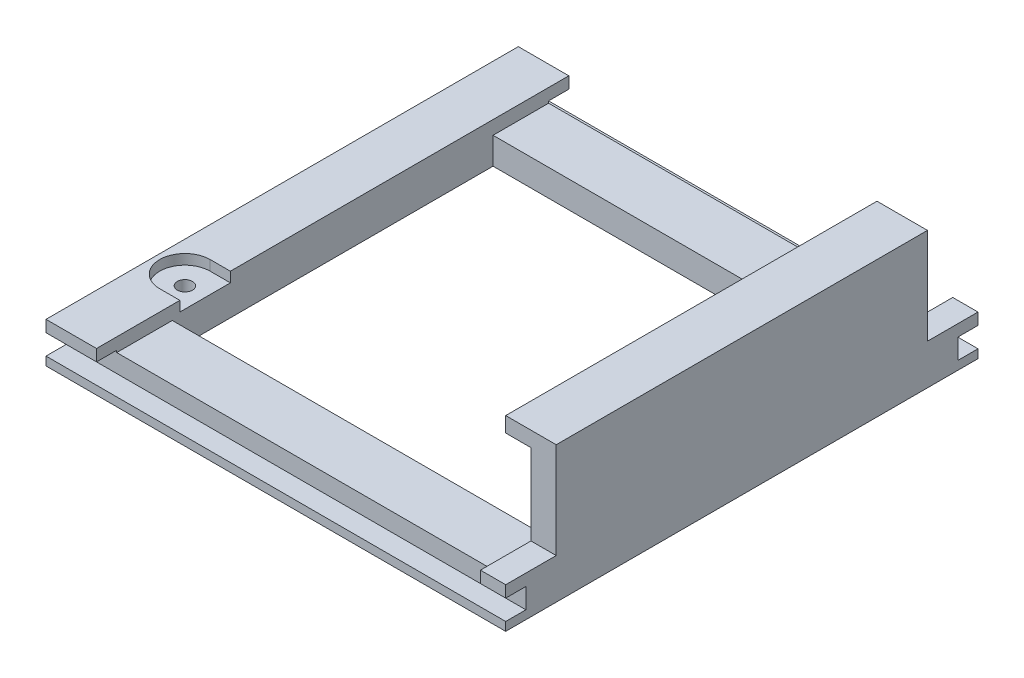
ISO-10303-21;
HEADER;
FILE_DESCRIPTION(('STEP AP214'),'2;1');
FILE_NAME('part.step','',(''),(''),'','','');
FILE_SCHEMA(('AUTOMOTIVE_DESIGN { 1 0 10303 214 1 1 1 1 }'));
ENDSEC;
DATA;
#1=APPLICATION_CONTEXT('core data for automotive mechanical design processes');
#2=APPLICATION_PROTOCOL_DEFINITION('international standard','automotive_design',2000,#1);
#3=PRODUCT_CONTEXT('',#1,'mechanical');
#4=PRODUCT('Part','Part','',(#3));
#5=PRODUCT_RELATED_PRODUCT_CATEGORY('part','',(#4));
#6=PRODUCT_DEFINITION_FORMATION('','',#4);
#7=PRODUCT_DEFINITION_CONTEXT('part definition',#1,'design');
#8=PRODUCT_DEFINITION('design','',#6,#7);
#9=PRODUCT_DEFINITION_SHAPE('','',#8);
#10=(LENGTH_UNIT() NAMED_UNIT(*) SI_UNIT(.MILLI.,.METRE.));
#11=(NAMED_UNIT(*) PLANE_ANGLE_UNIT() SI_UNIT($,.RADIAN.));
#12=(NAMED_UNIT(*) SI_UNIT($,.STERADIAN.) SOLID_ANGLE_UNIT());
#13=UNCERTAINTY_MEASURE_WITH_UNIT(LENGTH_MEASURE(1.E-05),#10,'distance_accuracy_value','');
#14=(GEOMETRIC_REPRESENTATION_CONTEXT(3) GLOBAL_UNCERTAINTY_ASSIGNED_CONTEXT((#13)) GLOBAL_UNIT_ASSIGNED_CONTEXT((#10,
#11,#12)) REPRESENTATION_CONTEXT('',''));
#15=CARTESIAN_POINT('',(0.,0.,0.));
#16=DIRECTION('',(0.,0.,1.));
#17=DIRECTION('',(1.,0.,0.));
#18=AXIS2_PLACEMENT_3D('',#15,#16,#17);
#19=CARTESIAN_POINT('',(43.,96.8478017212866,-46.75));
#20=DIRECTION('',(0.,0.,-1.));
#21=DIRECTION('',(-1.,0.,0.));
#22=AXIS2_PLACEMENT_3D('',#19,#20,#21);
#23=PLANE('',#22);
#24=DIRECTION('',(1.,0.,0.));
#25=VECTOR('',#24,1.);
#26=CARTESIAN_POINT('',(43.,5.7,-46.75));
#27=LINE('',#26,#25);
#28=CARTESIAN_POINT('',(-48.,5.7,-46.75));
#29=VERTEX_POINT('',#28);
#30=CARTESIAN_POINT('',(-38.,5.7,-46.75));
#31=VERTEX_POINT('',#30);
#32=EDGE_CURVE('E518',#29,#31,#27,.T.);
#33=ORIENTED_EDGE('',*,*,#32,.F.);
#34=DIRECTION('',(0.,-1.,0.));
#35=VECTOR('',#34,1.);
#36=CARTESIAN_POINT('',(-48.,96.8478017212866,-46.75));
#37=LINE('',#36,#35);
#38=CARTESIAN_POINT('',(-48.,8.,-46.75));
#39=VERTEX_POINT('',#38);
#40=EDGE_CURVE('E398',#39,#29,#37,.T.);
#41=ORIENTED_EDGE('',*,*,#40,.F.);
#42=DIRECTION('',(-1.,0.,0.));
#43=VECTOR('',#42,1.);
#44=CARTESIAN_POINT('',(-38.,8.,-46.75));
#45=LINE('',#44,#43);
#46=CARTESIAN_POINT('',(-38.,8.,-46.75));
#47=VERTEX_POINT('',#46);
#48=EDGE_CURVE('E346',#47,#39,#45,.T.);
#49=ORIENTED_EDGE('',*,*,#48,.F.);
#50=DIRECTION('',(0.,-1.,0.));
#51=VECTOR('',#50,1.);
#52=CARTESIAN_POINT('',(-38.,22.142135623731,-46.75));
#53=LINE('',#52,#51);
#54=EDGE_CURVE('E343',#47,#31,#53,.T.);
#55=ORIENTED_EDGE('',*,*,#54,.T.);
#56=EDGE_LOOP('',(#33,#41,#49,#55));
#57=FACE_BOUND('',#56,.T.);
#58=ADVANCED_FACE('F38',(#57),#23,.T.);
#59=DIRECTION('',(-1.,0.,0.));
#60=VECTOR('',#59,1.);
#61=CARTESIAN_POINT('',(43.,5.7,-46.75));
#62=LINE('',#61,#60);
#63=CARTESIAN_POINT('',(43.,5.7,-46.75));
#64=VERTEX_POINT('',#63);
#65=CARTESIAN_POINT('',(38.,5.7,-46.75));
#66=VERTEX_POINT('',#65);
#67=EDGE_CURVE('E291',#64,#66,#62,.T.);
#68=ORIENTED_EDGE('',*,*,#67,.T.);
#69=DIRECTION('',(0.,-1.,0.));
#70=VECTOR('',#69,1.);
#71=CARTESIAN_POINT('',(38.,22.142135623731,-46.75));
#72=LINE('',#71,#70);
#73=CARTESIAN_POINT('',(38.,8.,-46.75));
#74=VERTEX_POINT('',#73);
#75=EDGE_CURVE('E355',#74,#66,#72,.T.);
#76=ORIENTED_EDGE('',*,*,#75,.F.);
#77=DIRECTION('',(-1.,0.,0.));
#78=VECTOR('',#77,1.);
#79=CARTESIAN_POINT('',(43.,8.,-46.75));
#80=LINE('',#79,#78);
#81=CARTESIAN_POINT('',(43.,8.,-46.75));
#82=VERTEX_POINT('',#81);
#83=EDGE_CURVE('E369',#82,#74,#80,.T.);
#84=ORIENTED_EDGE('',*,*,#83,.F.);
#85=DIRECTION('',(0.,-1.,0.));
#86=VECTOR('',#85,1.);
#87=CARTESIAN_POINT('',(43.,96.8478017212866,-46.75));
#88=LINE('',#87,#86);
#89=EDGE_CURVE('E394',#82,#64,#88,.T.);
#90=ORIENTED_EDGE('',*,*,#89,.T.);
#91=EDGE_LOOP('',(#68,#76,#84,#90));
#92=FACE_BOUND('',#91,.T.);
#93=ADVANCED_FACE('F604',(#92),#23,.T.);
#94=CARTESIAN_POINT('',(43.,96.8478017212866,46.75));
#95=DIRECTION('',(0.,0.,1.));
#96=DIRECTION('',(1.,0.,0.));
#97=AXIS2_PLACEMENT_3D('',#94,#95,#96);
#98=PLANE('',#97);
#99=DIRECTION('',(-1.,0.,0.));
#100=VECTOR('',#99,1.);
#101=CARTESIAN_POINT('',(43.,1.7,46.75));
#102=LINE('',#101,#100);
#103=CARTESIAN_POINT('',(43.,1.7,46.75));
#104=VERTEX_POINT('',#103);
#105=CARTESIAN_POINT('',(-48.,1.7,46.75));
#106=VERTEX_POINT('',#105);
#107=EDGE_CURVE('E289',#104,#106,#102,.T.);
#108=ORIENTED_EDGE('',*,*,#107,.T.);
#109=DIRECTION('',(0.,-1.,0.));
#110=VECTOR('',#109,1.);
#111=CARTESIAN_POINT('',(-48.,96.8478017212866,46.75));
#112=LINE('',#111,#110);
#113=CARTESIAN_POINT('',(-48.,0.,46.75));
#114=VERTEX_POINT('',#113);
#115=EDGE_CURVE('E382',#106,#114,#112,.T.);
#116=ORIENTED_EDGE('',*,*,#115,.T.);
#117=DIRECTION('',(-1.,0.,0.));
#118=VECTOR('',#117,1.);
#119=CARTESIAN_POINT('',(43.,0.,46.75));
#120=LINE('',#119,#118);
#121=CARTESIAN_POINT('',(43.,0.,46.75));
#122=VERTEX_POINT('',#121);
#123=EDGE_CURVE('E368',#122,#114,#120,.T.);
#124=ORIENTED_EDGE('',*,*,#123,.F.);
#125=DIRECTION('',(0.,-1.,0.));
#126=VECTOR('',#125,1.);
#127=CARTESIAN_POINT('',(43.,96.8478017212866,46.75));
#128=LINE('',#127,#126);
#129=EDGE_CURVE('E386',#104,#122,#128,.T.);
#130=ORIENTED_EDGE('',*,*,#129,.F.);
#131=EDGE_LOOP('',(#108,#116,#124,#130));
#132=FACE_BOUND('',#131,.T.);
#133=ADVANCED_FACE('F602',(#132),#98,.T.);
#134=DIRECTION('',(-1.,0.,0.));
#135=VECTOR('',#134,1.);
#136=CARTESIAN_POINT('',(43.,5.7,46.75));
#137=LINE('',#136,#135);
#138=CARTESIAN_POINT('',(43.,5.7,46.75));
#139=VERTEX_POINT('',#138);
#140=CARTESIAN_POINT('',(38.,5.7,46.75));
#141=VERTEX_POINT('',#140);
#142=EDGE_CURVE('E306',#139,#141,#137,.T.);
#143=ORIENTED_EDGE('',*,*,#142,.F.);
#144=CARTESIAN_POINT('',(43.,8.,46.75));
#145=VERTEX_POINT('',#144);
#146=EDGE_CURVE('E387',#145,#139,#128,.T.);
#147=ORIENTED_EDGE('',*,*,#146,.F.);
#148=DIRECTION('',(1.,0.,0.));
#149=VECTOR('',#148,1.);
#150=CARTESIAN_POINT('',(43.,8.,46.75));
#151=LINE('',#150,#149);
#152=CARTESIAN_POINT('',(38.,8.,46.75));
#153=VERTEX_POINT('',#152);
#154=EDGE_CURVE('E361',#153,#145,#151,.T.);
#155=ORIENTED_EDGE('',*,*,#154,.F.);
#156=DIRECTION('',(0.,-1.,0.));
#157=VECTOR('',#156,1.);
#158=CARTESIAN_POINT('',(38.,22.142135623731,46.75));
#159=LINE('',#158,#157);
#160=EDGE_CURVE('E349',#153,#141,#159,.T.);
#161=ORIENTED_EDGE('',*,*,#160,.T.);
#162=EDGE_LOOP('',(#143,#147,#155,#161));
#163=FACE_BOUND('',#162,.T.);
#164=ADVANCED_FACE('F554',(#163),#98,.T.);
#165=CARTESIAN_POINT('',(0.,5.3,0.));
#166=DIRECTION('',(0.,-1.,0.));
#167=DIRECTION('',(0.,0.,-1.));
#168=AXIS2_PLACEMENT_3D('',#165,#166,#167);
#169=PLANE('',#168);
#170=DIRECTION('',(0.,0.,1.));
#171=VECTOR('',#170,1.);
#172=CARTESIAN_POINT('',(-38.,5.3,31.75));
#173=LINE('',#172,#171);
#174=CARTESIAN_POINT('',(-38.,5.3,31.75));
#175=VERTEX_POINT('',#174);
#176=CARTESIAN_POINT('',(-38.,5.3,42.75));
#177=VERTEX_POINT('',#176);
#178=EDGE_CURVE('E433',#175,#177,#173,.T.);
#179=ORIENTED_EDGE('',*,*,#178,.T.);
#180=DIRECTION('',(1.,0.,0.));
#181=VECTOR('',#180,1.);
#182=CARTESIAN_POINT('',(0.,5.3,42.75));
#183=LINE('',#182,#181);
#184=CARTESIAN_POINT('',(38.,5.3,42.75));
#185=VERTEX_POINT('',#184);
#186=EDGE_CURVE('E330',#177,#185,#183,.T.);
#187=ORIENTED_EDGE('',*,*,#186,.T.);
#188=DIRECTION('',(0.,0.,-1.));
#189=VECTOR('',#188,1.);
#190=CARTESIAN_POINT('',(38.,5.3,31.75));
#191=LINE('',#190,#189);
#192=CARTESIAN_POINT('',(38.,5.3,31.75));
#193=VERTEX_POINT('',#192);
#194=EDGE_CURVE('E427',#185,#193,#191,.T.);
#195=ORIENTED_EDGE('',*,*,#194,.T.);
#196=DIRECTION('',(-1.,0.,0.));
#197=VECTOR('',#196,1.);
#198=CARTESIAN_POINT('',(38.,5.3,31.75));
#199=LINE('',#198,#197);
#200=EDGE_CURVE('E429',#193,#175,#199,.T.);
#201=ORIENTED_EDGE('',*,*,#200,.T.);
#202=EDGE_LOOP('',(#179,#187,#195,#201));
#203=FACE_BOUND('',#202,.T.);
#204=ADVANCED_FACE('F562',(#203),#169,.F.);
#205=CARTESIAN_POINT('',(0.,5.3,0.));
#206=DIRECTION('',(0.,1.,0.));
#207=DIRECTION('',(0.,0.,1.));
#208=AXIS2_PLACEMENT_3D('',#205,#206,#207);
#209=PLANE('',#208);
#210=DIRECTION('',(1.,0.,0.));
#211=VECTOR('',#210,1.);
#212=CARTESIAN_POINT('',(0.,5.3,-42.75));
#213=LINE('',#212,#211);
#214=CARTESIAN_POINT('',(-38.,5.3,-42.75));
#215=VERTEX_POINT('',#214);
#216=CARTESIAN_POINT('',(38.,5.3,-42.75));
#217=VERTEX_POINT('',#216);
#218=EDGE_CURVE('E335',#215,#217,#213,.T.);
#219=ORIENTED_EDGE('',*,*,#218,.F.);
#220=DIRECTION('',(0.,0.,1.));
#221=VECTOR('',#220,1.);
#222=CARTESIAN_POINT('',(-38.,5.3,-31.75));
#223=LINE('',#222,#221);
#224=CARTESIAN_POINT('',(-38.,5.3,-31.75));
#225=VERTEX_POINT('',#224);
#226=EDGE_CURVE('E441',#215,#225,#223,.T.);
#227=ORIENTED_EDGE('',*,*,#226,.T.);
#228=DIRECTION('',(1.,0.,0.));
#229=VECTOR('',#228,1.);
#230=CARTESIAN_POINT('',(38.,5.3,-31.75));
#231=LINE('',#230,#229);
#232=CARTESIAN_POINT('',(38.,5.3,-31.75));
#233=VERTEX_POINT('',#232);
#234=EDGE_CURVE('E443',#225,#233,#231,.T.);
#235=ORIENTED_EDGE('',*,*,#234,.T.);
#236=DIRECTION('',(0.,0.,-1.));
#237=VECTOR('',#236,1.);
#238=CARTESIAN_POINT('',(38.,5.3,-31.75));
#239=LINE('',#238,#237);
#240=EDGE_CURVE('E409',#233,#217,#239,.T.);
#241=ORIENTED_EDGE('',*,*,#240,.T.);
#242=EDGE_LOOP('',(#219,#227,#235,#241));
#243=FACE_BOUND('',#242,.T.);
#244=ADVANCED_FACE('F583',(#243),#209,.T.);
#245=CARTESIAN_POINT('',(43.,8.,-36.75));
#246=DIRECTION('',(0.,0.,1.));
#247=DIRECTION('',(1.,0.,0.));
#248=AXIS2_PLACEMENT_3D('',#245,#246,#247);
#249=PLANE('',#248);
#250=DIRECTION('',(0.,-1.,0.));
#251=VECTOR('',#250,1.);
#252=CARTESIAN_POINT('',(43.,8.,-36.75));
#253=LINE('',#252,#251);
#254=CARTESIAN_POINT('',(43.,27.,-36.75));
#255=VERTEX_POINT('',#254);
#256=CARTESIAN_POINT('',(43.,8.,-36.75));
#257=VERTEX_POINT('',#256);
#258=EDGE_CURVE('E504',#255,#257,#253,.T.);
#259=ORIENTED_EDGE('',*,*,#258,.T.);
#260=DIRECTION('',(1.,0.,0.));
#261=VECTOR('',#260,1.);
#262=CARTESIAN_POINT('',(43.,8.,-36.75));
#263=LINE('',#262,#261);
#264=CARTESIAN_POINT('',(38.,8.,-36.75));
#265=VERTEX_POINT('',#264);
#266=EDGE_CURVE('E375',#265,#257,#263,.T.);
#267=ORIENTED_EDGE('',*,*,#266,.F.);
#268=DIRECTION('',(0.,1.,0.));
#269=VECTOR('',#268,1.);
#270=CARTESIAN_POINT('',(38.,5.3,-36.75));
#271=LINE('',#270,#269);
#272=CARTESIAN_POINT('',(38.,24.,-36.75));
#273=VERTEX_POINT('',#272);
#274=EDGE_CURVE('E430',#265,#273,#271,.T.);
#275=ORIENTED_EDGE('',*,*,#274,.T.);
#276=DIRECTION('',(-1.,0.,0.));
#277=VECTOR('',#276,1.);
#278=CARTESIAN_POINT('',(38.,24.,-36.75));
#279=LINE('',#278,#277);
#280=CARTESIAN_POINT('',(33.,24.,-36.75));
#281=VERTEX_POINT('',#280);
#282=EDGE_CURVE('E397',#273,#281,#279,.T.);
#283=ORIENTED_EDGE('',*,*,#282,.T.);
#284=DIRECTION('',(0.,1.,0.));
#285=VECTOR('',#284,1.);
#286=CARTESIAN_POINT('',(33.,27.,-36.75));
#287=LINE('',#286,#285);
#288=CARTESIAN_POINT('',(33.,27.,-36.75));
#289=VERTEX_POINT('',#288);
#290=EDGE_CURVE('E412',#281,#289,#287,.T.);
#291=ORIENTED_EDGE('',*,*,#290,.T.);
#292=DIRECTION('',(1.,0.,0.));
#293=VECTOR('',#292,1.);
#294=CARTESIAN_POINT('',(43.,27.,-36.75));
#295=LINE('',#294,#293);
#296=EDGE_CURVE('E415',#289,#255,#295,.T.);
#297=ORIENTED_EDGE('',*,*,#296,.T.);
#298=EDGE_LOOP('',(#259,#267,#275,#283,#291,#297));
#299=FACE_BOUND('',#298,.T.);
#300=ADVANCED_FACE('F40',(#299),#249,.F.);
#301=CARTESIAN_POINT('',(-38.,8.,-31.75));
#302=DIRECTION('',(0.,0.,1.));
#303=DIRECTION('',(1.,0.,0.));
#304=AXIS2_PLACEMENT_3D('',#301,#302,#303);
#305=PLANE('',#304);
#306=DIRECTION('',(0.,-1.,0.));
#307=VECTOR('',#306,1.);
#308=CARTESIAN_POINT('',(38.,8.,-31.75));
#309=LINE('',#308,#307);
#310=CARTESIAN_POINT('',(38.,0.,-31.75));
#311=VERTEX_POINT('',#310);
#312=EDGE_CURVE('E499',#233,#311,#309,.T.);
#313=ORIENTED_EDGE('',*,*,#312,.F.);
#314=ORIENTED_EDGE('',*,*,#234,.F.);
#315=DIRECTION('',(0.,-1.,0.));
#316=VECTOR('',#315,1.);
#317=CARTESIAN_POINT('',(-38.,8.,-31.75));
#318=LINE('',#317,#316);
#319=CARTESIAN_POINT('',(-38.,0.,-31.75));
#320=VERTEX_POINT('',#319);
#321=EDGE_CURVE('E497',#225,#320,#318,.T.);
#322=ORIENTED_EDGE('',*,*,#321,.T.);
#323=DIRECTION('',(-1.,0.,0.));
#324=VECTOR('',#323,1.);
#325=CARTESIAN_POINT('',(-38.,0.,-31.75));
#326=LINE('',#325,#324);
#327=EDGE_CURVE('E485',#311,#320,#326,.T.);
#328=ORIENTED_EDGE('',*,*,#327,.F.);
#329=EDGE_LOOP('',(#313,#314,#322,#328));
#330=FACE_BOUND('',#329,.T.);
#331=ADVANCED_FACE('F579',(#330),#305,.T.);
#332=CARTESIAN_POINT('',(-42.,8.,25.25));
#333=DIRECTION('',(0.,-1.,0.));
#334=DIRECTION('',(0.,0.,-1.));
#335=AXIS2_PLACEMENT_3D('',#332,#333,#334);
#336=CYLINDRICAL_SURFACE('',#335,1.5);
#337=CARTESIAN_POINT('',(-42.,0.,25.25));
#338=DIRECTION('',(0.,1.,0.));
#339=DIRECTION('',(0.,0.,1.));
#340=AXIS2_PLACEMENT_3D('',#337,#338,#339);
#341=CIRCLE('',#340,1.5);
#342=CARTESIAN_POINT('',(-42.,0.,26.75));
#343=VERTEX_POINT('',#342);
#344=EDGE_CURVE('E474',#343,#343,#341,.T.);
#345=ORIENTED_EDGE('',*,*,#344,.F.);
#346=EDGE_LOOP('',(#345));
#347=FACE_BOUND('',#346,.T.);
#348=CARTESIAN_POINT('',(-42.,6.,25.25));
#349=DIRECTION('',(0.,1.,0.));
#350=DIRECTION('',(0.,0.,1.));
#351=AXIS2_PLACEMENT_3D('',#348,#349,#350);
#352=CIRCLE('',#351,1.5);
#353=CARTESIAN_POINT('',(-42.,6.,26.75));
#354=VERTEX_POINT('',#353);
#355=EDGE_CURVE('E467',#354,#354,#352,.T.);
#356=ORIENTED_EDGE('',*,*,#355,.T.);
#357=EDGE_LOOP('',(#356));
#358=FACE_BOUND('',#357,.T.);
#359=ADVANCED_FACE('F655',(#347,#358),#336,.F.);
#360=CARTESIAN_POINT('',(0.,8.,0.));
#361=DIRECTION('',(0.,1.,0.));
#362=DIRECTION('',(0.,0.,1.));
#363=AXIS2_PLACEMENT_3D('',#360,#361,#362);
#364=PLANE('',#363);
#365=DIRECTION('',(0.,0.,1.));
#366=VECTOR('',#365,1.);
#367=CARTESIAN_POINT('',(-48.,8.,-36.75));
#368=LINE('',#367,#366);
#369=CARTESIAN_POINT('',(-48.,8.,46.75));
#370=VERTEX_POINT('',#369);
#371=EDGE_CURVE('E502',#39,#370,#368,.T.);
#372=ORIENTED_EDGE('',*,*,#371,.T.);
#373=DIRECTION('',(1.,0.,0.));
#374=VECTOR('',#373,1.);
#375=CARTESIAN_POINT('',(-38.,8.,46.75));
#376=LINE('',#375,#374);
#377=CARTESIAN_POINT('',(-38.,8.,46.75));
#378=VERTEX_POINT('',#377);
#379=EDGE_CURVE('E340',#370,#378,#376,.T.);
#380=ORIENTED_EDGE('',*,*,#379,.T.);
#381=DIRECTION('',(0.,0.,1.));
#382=VECTOR('',#381,1.);
#383=CARTESIAN_POINT('',(-38.,8.,31.75));
#384=LINE('',#383,#382);
#385=CARTESIAN_POINT('',(-38.,8.,30.25));
#386=VERTEX_POINT('',#385);
#387=EDGE_CURVE('E482',#386,#378,#384,.T.);
#388=ORIENTED_EDGE('',*,*,#387,.F.);
#389=DIRECTION('',(1.,0.,0.));
#390=VECTOR('',#389,1.);
#391=CARTESIAN_POINT('',(-42.,8.,30.25));
#392=LINE('',#391,#390);
#393=CARTESIAN_POINT('',(-42.,8.,30.25));
#394=VERTEX_POINT('',#393);
#395=EDGE_CURVE('E461',#394,#386,#392,.T.);
#396=ORIENTED_EDGE('',*,*,#395,.F.);
#397=CARTESIAN_POINT('',(-42.,8.,25.25));
#398=DIRECTION('',(0.,1.,0.));
#399=DIRECTION('',(0.,0.,1.));
#400=AXIS2_PLACEMENT_3D('',#397,#398,#399);
#401=CIRCLE('',#400,5.);
#402=CARTESIAN_POINT('',(-42.,8.,20.25));
#403=VERTEX_POINT('',#402);
#404=EDGE_CURVE('E438',#403,#394,#401,.T.);
#405=ORIENTED_EDGE('',*,*,#404,.F.);
#406=DIRECTION('',(-1.,0.,0.));
#407=VECTOR('',#406,1.);
#408=CARTESIAN_POINT('',(-38.,8.,20.25));
#409=LINE('',#408,#407);
#410=CARTESIAN_POINT('',(-38.,8.,20.25));
#411=VERTEX_POINT('',#410);
#412=EDGE_CURVE('E451',#411,#403,#409,.T.);
#413=ORIENTED_EDGE('',*,*,#412,.F.);
#414=EDGE_CURVE('E478',#47,#411,#384,.T.);
#415=ORIENTED_EDGE('',*,*,#414,.F.);
#416=ORIENTED_EDGE('',*,*,#48,.T.);
#417=EDGE_LOOP('',(#372,#380,#388,#396,#405,#413,#415,#416));
#418=FACE_BOUND('',#417,.T.);
#419=ADVANCED_FACE('F534',(#418),#364,.T.);
#420=CARTESIAN_POINT('',(0.,0.,0.));
#421=DIRECTION('',(0.,1.,0.));
#422=DIRECTION('',(0.,0.,1.));
#423=AXIS2_PLACEMENT_3D('',#420,#421,#422);
#424=PLANE('',#423);
#425=DIRECTION('',(0.,0.,1.));
#426=VECTOR('',#425,1.);
#427=CARTESIAN_POINT('',(-48.,0.,-36.75));
#428=LINE('',#427,#426);
#429=CARTESIAN_POINT('',(-48.,0.,-46.75));
#430=VERTEX_POINT('',#429);
#431=EDGE_CURVE('E501',#430,#114,#428,.T.);
#432=ORIENTED_EDGE('',*,*,#431,.F.);
#433=DIRECTION('',(1.,0.,0.));
#434=VECTOR('',#433,1.);
#435=CARTESIAN_POINT('',(43.,0.,-46.75));
#436=LINE('',#435,#434);
#437=CARTESIAN_POINT('',(43.,0.,-46.75));
#438=VERTEX_POINT('',#437);
#439=EDGE_CURVE('E390',#430,#438,#436,.T.);
#440=ORIENTED_EDGE('',*,*,#439,.T.);
#441=DIRECTION('',(0.,0.,-1.));
#442=VECTOR('',#441,1.);
#443=CARTESIAN_POINT('',(43.,0.,36.75));
#444=LINE('',#443,#442);
#445=EDGE_CURVE('E505',#122,#438,#444,.T.);
#446=ORIENTED_EDGE('',*,*,#445,.F.);
#447=ORIENTED_EDGE('',*,*,#123,.T.);
#448=EDGE_LOOP('',(#432,#440,#446,#447));
#449=FACE_BOUND('',#448,.T.);
#450=DIRECTION('',(0.,0.,-1.));
#451=VECTOR('',#450,1.);
#452=CARTESIAN_POINT('',(38.,0.,31.75));
#453=LINE('',#452,#451);
#454=CARTESIAN_POINT('',(38.,0.,31.75));
#455=VERTEX_POINT('',#454);
#456=EDGE_CURVE('E477',#455,#311,#453,.T.);
#457=ORIENTED_EDGE('',*,*,#456,.T.);
#458=ORIENTED_EDGE('',*,*,#327,.T.);
#459=DIRECTION('',(0.,0.,1.));
#460=VECTOR('',#459,1.);
#461=CARTESIAN_POINT('',(-38.,0.,31.75));
#462=LINE('',#461,#460);
#463=CARTESIAN_POINT('',(-38.,0.,31.75));
#464=VERTEX_POINT('',#463);
#465=EDGE_CURVE('E488',#320,#464,#462,.T.);
#466=ORIENTED_EDGE('',*,*,#465,.T.);
#467=DIRECTION('',(1.,0.,0.));
#468=VECTOR('',#467,1.);
#469=CARTESIAN_POINT('',(-38.,0.,31.75));
#470=LINE('',#469,#468);
#471=EDGE_CURVE('E491',#464,#455,#470,.T.);
#472=ORIENTED_EDGE('',*,*,#471,.T.);
#473=EDGE_LOOP('',(#457,#458,#466,#472));
#474=FACE_BOUND('',#473,.T.);
#475=ORIENTED_EDGE('',*,*,#344,.T.);
#476=EDGE_LOOP('',(#475));
#477=FACE_BOUND('',#476,.T.);
#478=ADVANCED_FACE('F575',(#449,#474,#477),#424,.F.);
#479=CARTESIAN_POINT('',(-48.,8.,-36.75));
#480=DIRECTION('',(1.,0.,0.));
#481=DIRECTION('',(0.,0.,-1.));
#482=AXIS2_PLACEMENT_3D('',#479,#480,#481);
#483=PLANE('',#482);
#484=ORIENTED_EDGE('',*,*,#40,.T.);
#485=DIRECTION('',(0.,0.,-1.));
#486=VECTOR('',#485,1.);
#487=CARTESIAN_POINT('',(-48.,5.7,-46.75));
#488=LINE('',#487,#486);
#489=CARTESIAN_POINT('',(-48.,5.7,-42.75));
#490=VERTEX_POINT('',#489);
#491=EDGE_CURVE('E282',#490,#29,#488,.T.);
#492=ORIENTED_EDGE('',*,*,#491,.F.);
#493=DIRECTION('',(0.,1.,0.));
#494=VECTOR('',#493,1.);
#495=CARTESIAN_POINT('',(-48.,1.7,-42.75));
#496=LINE('',#495,#494);
#497=CARTESIAN_POINT('',(-48.,1.7,-42.75));
#498=VERTEX_POINT('',#497);
#499=EDGE_CURVE('E284',#498,#490,#496,.T.);
#500=ORIENTED_EDGE('',*,*,#499,.F.);
#501=DIRECTION('',(0.,0.,1.));
#502=VECTOR('',#501,1.);
#503=CARTESIAN_POINT('',(-48.,1.7,-46.75));
#504=LINE('',#503,#502);
#505=CARTESIAN_POINT('',(-48.,1.7,-46.75));
#506=VERTEX_POINT('',#505);
#507=EDGE_CURVE('E261',#506,#498,#504,.T.);
#508=ORIENTED_EDGE('',*,*,#507,.F.);
#509=EDGE_CURVE('E393',#506,#430,#37,.T.);
#510=ORIENTED_EDGE('',*,*,#509,.T.);
#511=ORIENTED_EDGE('',*,*,#431,.T.);
#512=ORIENTED_EDGE('',*,*,#115,.F.);
#513=DIRECTION('',(0.,0.,1.));
#514=VECTOR('',#513,1.);
#515=CARTESIAN_POINT('',(-48.,1.7,46.75));
#516=LINE('',#515,#514);
#517=CARTESIAN_POINT('',(-48.,1.7,42.75));
#518=VERTEX_POINT('',#517);
#519=EDGE_CURVE('E300',#518,#106,#516,.T.);
#520=ORIENTED_EDGE('',*,*,#519,.F.);
#521=DIRECTION('',(0.,-1.,0.));
#522=VECTOR('',#521,1.);
#523=CARTESIAN_POINT('',(-48.,1.7,42.75));
#524=LINE('',#523,#522);
#525=CARTESIAN_POINT('',(-48.,5.7,42.75));
#526=VERTEX_POINT('',#525);
#527=EDGE_CURVE('E310',#526,#518,#524,.T.);
#528=ORIENTED_EDGE('',*,*,#527,.F.);
#529=DIRECTION('',(0.,0.,-1.));
#530=VECTOR('',#529,1.);
#531=CARTESIAN_POINT('',(-48.,5.7,46.75));
#532=LINE('',#531,#530);
#533=CARTESIAN_POINT('',(-48.,5.7,46.75));
#534=VERTEX_POINT('',#533);
#535=EDGE_CURVE('E307',#534,#526,#532,.T.);
#536=ORIENTED_EDGE('',*,*,#535,.F.);
#537=EDGE_CURVE('E383',#370,#534,#112,.T.);
#538=ORIENTED_EDGE('',*,*,#537,.F.);
#539=ORIENTED_EDGE('',*,*,#371,.F.);
#540=EDGE_LOOP('',(#484,#492,#500,#508,#510,#511,#512,#520,#528,#536,#538,#539));
#541=FACE_BOUND('',#540,.T.);
#542=ADVANCED_FACE('F540',(#541),#483,.F.);
#543=CARTESIAN_POINT('',(-48.,8.,36.75));
#544=DIRECTION('',(0.,0.,-1.));
#545=DIRECTION('',(-1.,0.,0.));
#546=AXIS2_PLACEMENT_3D('',#543,#544,#545);
#547=PLANE('',#546);
#548=DIRECTION('',(0.,1.,0.));
#549=VECTOR('',#548,1.);
#550=CARTESIAN_POINT('',(38.,5.3,36.75));
#551=LINE('',#550,#549);
#552=CARTESIAN_POINT('',(38.,8.,36.75));
#553=VERTEX_POINT('',#552);
#554=CARTESIAN_POINT('',(38.,24.,36.75));
#555=VERTEX_POINT('',#554);
#556=EDGE_CURVE('E436',#553,#555,#551,.T.);
#557=ORIENTED_EDGE('',*,*,#556,.F.);
#558=DIRECTION('',(-1.,0.,0.));
#559=VECTOR('',#558,1.);
#560=CARTESIAN_POINT('',(43.,8.,36.75));
#561=LINE('',#560,#559);
#562=CARTESIAN_POINT('',(43.,8.,36.75));
#563=VERTEX_POINT('',#562);
#564=EDGE_CURVE('E356',#563,#553,#561,.T.);
#565=ORIENTED_EDGE('',*,*,#564,.F.);
#566=DIRECTION('',(0.,-1.,0.));
#567=VECTOR('',#566,1.);
#568=CARTESIAN_POINT('',(43.,8.,36.75));
#569=LINE('',#568,#567);
#570=CARTESIAN_POINT('',(43.,27.,36.75));
#571=VERTEX_POINT('',#570);
#572=EDGE_CURVE('E511',#571,#563,#569,.T.);
#573=ORIENTED_EDGE('',*,*,#572,.F.);
#574=DIRECTION('',(-1.,0.,0.));
#575=VECTOR('',#574,1.);
#576=CARTESIAN_POINT('',(43.,27.,36.75));
#577=LINE('',#576,#575);
#578=CARTESIAN_POINT('',(33.,27.,36.75));
#579=VERTEX_POINT('',#578);
#580=EDGE_CURVE('E407',#571,#579,#577,.T.);
#581=ORIENTED_EDGE('',*,*,#580,.T.);
#582=DIRECTION('',(0.,-1.,0.));
#583=VECTOR('',#582,1.);
#584=CARTESIAN_POINT('',(33.,27.,36.75));
#585=LINE('',#584,#583);
#586=CARTESIAN_POINT('',(33.,24.,36.75));
#587=VERTEX_POINT('',#586);
#588=EDGE_CURVE('E404',#579,#587,#585,.T.);
#589=ORIENTED_EDGE('',*,*,#588,.T.);
#590=DIRECTION('',(1.,0.,0.));
#591=VECTOR('',#590,1.);
#592=CARTESIAN_POINT('',(38.,24.,36.75));
#593=LINE('',#592,#591);
#594=EDGE_CURVE('E401',#587,#555,#593,.T.);
#595=ORIENTED_EDGE('',*,*,#594,.T.);
#596=EDGE_LOOP('',(#557,#565,#573,#581,#589,#595));
#597=FACE_BOUND('',#596,.T.);
#598=ADVANCED_FACE('F673',(#597),#547,.F.);
#599=CARTESIAN_POINT('',(43.,8.,36.75));
#600=DIRECTION('',(-1.,0.,0.));
#601=DIRECTION('',(0.,0.,1.));
#602=AXIS2_PLACEMENT_3D('',#599,#600,#601);
#603=PLANE('',#602);
#604=DIRECTION('',(0.,1.,0.));
#605=VECTOR('',#604,1.);
#606=CARTESIAN_POINT('',(43.,1.7,-42.75));
#607=LINE('',#606,#605);
#608=CARTESIAN_POINT('',(43.,1.7,-42.75));
#609=VERTEX_POINT('',#608);
#610=CARTESIAN_POINT('',(43.,5.7,-42.75));
#611=VERTEX_POINT('',#610);
#612=EDGE_CURVE('E269',#609,#611,#607,.T.);
#613=ORIENTED_EDGE('',*,*,#612,.T.);
#614=DIRECTION('',(0.,0.,-1.));
#615=VECTOR('',#614,1.);
#616=CARTESIAN_POINT('',(43.,5.7,-46.75));
#617=LINE('',#616,#615);
#618=EDGE_CURVE('E276',#611,#64,#617,.T.);
#619=ORIENTED_EDGE('',*,*,#618,.T.);
#620=ORIENTED_EDGE('',*,*,#89,.F.);
#621=DIRECTION('',(0.,0.,-1.));
#622=VECTOR('',#621,1.);
#623=CARTESIAN_POINT('',(43.,8.,-46.75));
#624=LINE('',#623,#622);
#625=EDGE_CURVE('E372',#257,#82,#624,.T.);
#626=ORIENTED_EDGE('',*,*,#625,.F.);
#627=ORIENTED_EDGE('',*,*,#258,.F.);
#628=DIRECTION('',(0.,0.,-1.));
#629=VECTOR('',#628,1.);
#630=CARTESIAN_POINT('',(43.,27.,58.2209105535839));
#631=LINE('',#630,#629);
#632=EDGE_CURVE('E405',#571,#255,#631,.T.);
#633=ORIENTED_EDGE('',*,*,#632,.F.);
#634=ORIENTED_EDGE('',*,*,#572,.T.);
#635=DIRECTION('',(0.,0.,-1.));
#636=VECTOR('',#635,1.);
#637=CARTESIAN_POINT('',(43.,8.,46.75));
#638=LINE('',#637,#636);
#639=EDGE_CURVE('E359',#145,#563,#638,.T.);
#640=ORIENTED_EDGE('',*,*,#639,.F.);
#641=ORIENTED_EDGE('',*,*,#146,.T.);
#642=DIRECTION('',(0.,0.,-1.));
#643=VECTOR('',#642,1.);
#644=CARTESIAN_POINT('',(43.,5.7,46.75));
#645=LINE('',#644,#643);
#646=CARTESIAN_POINT('',(43.,5.7,42.75));
#647=VERTEX_POINT('',#646);
#648=EDGE_CURVE('E296',#139,#647,#645,.T.);
#649=ORIENTED_EDGE('',*,*,#648,.T.);
#650=DIRECTION('',(0.,-1.,0.));
#651=VECTOR('',#650,1.);
#652=CARTESIAN_POINT('',(43.,1.7,42.75));
#653=LINE('',#652,#651);
#654=CARTESIAN_POINT('',(43.,1.7,42.75));
#655=VERTEX_POINT('',#654);
#656=EDGE_CURVE('E299',#647,#655,#653,.T.);
#657=ORIENTED_EDGE('',*,*,#656,.T.);
#658=DIRECTION('',(0.,0.,1.));
#659=VECTOR('',#658,1.);
#660=CARTESIAN_POINT('',(43.,1.7,46.75));
#661=LINE('',#660,#659);
#662=EDGE_CURVE('E303',#655,#104,#661,.T.);
#663=ORIENTED_EDGE('',*,*,#662,.T.);
#664=ORIENTED_EDGE('',*,*,#129,.T.);
#665=ORIENTED_EDGE('',*,*,#445,.T.);
#666=CARTESIAN_POINT('',(43.,1.70000000000001,-46.75));
#667=VERTEX_POINT('',#666);
#668=EDGE_CURVE('E281',#667,#438,#88,.T.);
#669=ORIENTED_EDGE('',*,*,#668,.F.);
#670=DIRECTION('',(0.,0.,1.));
#671=VECTOR('',#670,1.);
#672=CARTESIAN_POINT('',(43.,1.7,-46.75));
#673=LINE('',#672,#671);
#674=EDGE_CURVE('E53',#667,#609,#673,.T.);
#675=ORIENTED_EDGE('',*,*,#674,.T.);
#676=EDGE_LOOP('',(#613,#619,#620,#626,#627,#633,#634,#640,#641,#649,#657,#663,#664,#665,#669,#675));
#677=FACE_BOUND('',#676,.T.);
#678=ADVANCED_FACE('F279',(#677),#603,.F.);
#679=CARTESIAN_POINT('',(38.,8.,31.75));
#680=DIRECTION('',(-1.,0.,0.));
#681=DIRECTION('',(0.,0.,1.));
#682=AXIS2_PLACEMENT_3D('',#679,#680,#681);
#683=PLANE('',#682);
#684=DIRECTION('',(0.,0.,-1.));
#685=VECTOR('',#684,1.);
#686=CARTESIAN_POINT('',(38.,5.7,31.75));
#687=LINE('',#686,#685);
#688=CARTESIAN_POINT('',(38.,5.7,-42.75));
#689=VERTEX_POINT('',#688);
#690=EDGE_CURVE('E328',#689,#66,#687,.T.);
#691=ORIENTED_EDGE('',*,*,#690,.F.);
#692=DIRECTION('',(0.,1.,0.));
#693=VECTOR('',#692,1.);
#694=CARTESIAN_POINT('',(38.,8.,-42.75));
#695=LINE('',#694,#693);
#696=EDGE_CURVE('E337',#217,#689,#695,.T.);
#697=ORIENTED_EDGE('',*,*,#696,.F.);
#698=ORIENTED_EDGE('',*,*,#240,.F.);
#699=ORIENTED_EDGE('',*,*,#312,.T.);
#700=ORIENTED_EDGE('',*,*,#456,.F.);
#701=DIRECTION('',(0.,-1.,0.));
#702=VECTOR('',#701,1.);
#703=CARTESIAN_POINT('',(38.,8.,31.75));
#704=LINE('',#703,#702);
#705=EDGE_CURVE('E481',#193,#455,#704,.T.);
#706=ORIENTED_EDGE('',*,*,#705,.F.);
#707=ORIENTED_EDGE('',*,*,#194,.F.);
#708=DIRECTION('',(0.,-1.,0.));
#709=VECTOR('',#708,1.);
#710=CARTESIAN_POINT('',(38.,8.,42.75));
#711=LINE('',#710,#709);
#712=CARTESIAN_POINT('',(38.,5.7,42.75));
#713=VERTEX_POINT('',#712);
#714=EDGE_CURVE('E333',#713,#185,#711,.T.);
#715=ORIENTED_EDGE('',*,*,#714,.F.);
#716=DIRECTION('',(0.,0.,-1.));
#717=VECTOR('',#716,1.);
#718=CARTESIAN_POINT('',(38.,5.69999999999999,31.75));
#719=LINE('',#718,#717);
#720=EDGE_CURVE('E324',#141,#713,#719,.T.);
#721=ORIENTED_EDGE('',*,*,#720,.F.);
#722=ORIENTED_EDGE('',*,*,#160,.F.);
#723=DIRECTION('',(0.,0.,1.));
#724=VECTOR('',#723,1.);
#725=CARTESIAN_POINT('',(38.,8.,46.75));
#726=LINE('',#725,#724);
#727=EDGE_CURVE('E352',#553,#153,#726,.T.);
#728=ORIENTED_EDGE('',*,*,#727,.F.);
#729=ORIENTED_EDGE('',*,*,#556,.T.);
#730=DIRECTION('',(0.,0.,-1.));
#731=VECTOR('',#730,1.);
#732=CARTESIAN_POINT('',(38.,24.,58.2209105535839));
#733=LINE('',#732,#731);
#734=EDGE_CURVE('E418',#555,#273,#733,.T.);
#735=ORIENTED_EDGE('',*,*,#734,.T.);
#736=ORIENTED_EDGE('',*,*,#274,.F.);
#737=DIRECTION('',(0.,0.,1.));
#738=VECTOR('',#737,1.);
#739=CARTESIAN_POINT('',(38.,8.,-46.75));
#740=LINE('',#739,#738);
#741=EDGE_CURVE('E366',#74,#265,#740,.T.);
#742=ORIENTED_EDGE('',*,*,#741,.F.);
#743=ORIENTED_EDGE('',*,*,#75,.T.);
#744=EDGE_LOOP('',(#691,#697,#698,#699,#700,#706,#707,#715,#721,#722,#728,#729,#735,#736,#742,#743));
#745=FACE_BOUND('',#744,.T.);
#746=ADVANCED_FACE('F558',(#745),#683,.T.);
#747=CARTESIAN_POINT('',(-38.,8.,31.75));
#748=DIRECTION('',(1.,0.,0.));
#749=DIRECTION('',(0.,0.,-1.));
#750=AXIS2_PLACEMENT_3D('',#747,#748,#749);
#751=PLANE('',#750);
#752=DIRECTION('',(0.,0.,1.));
#753=VECTOR('',#752,1.);
#754=CARTESIAN_POINT('',(-38.,5.7,31.75));
#755=LINE('',#754,#753);
#756=CARTESIAN_POINT('',(-38.,5.7,-42.75));
#757=VERTEX_POINT('',#756);
#758=EDGE_CURVE('E326',#31,#757,#755,.T.);
#759=ORIENTED_EDGE('',*,*,#758,.F.);
#760=ORIENTED_EDGE('',*,*,#54,.F.);
#761=ORIENTED_EDGE('',*,*,#414,.T.);
#762=DIRECTION('',(0.,1.,0.));
#763=VECTOR('',#762,1.);
#764=CARTESIAN_POINT('',(-38.,6.,20.25));
#765=LINE('',#764,#763);
#766=CARTESIAN_POINT('',(-38.,6.,20.25));
#767=VERTEX_POINT('',#766);
#768=EDGE_CURVE('E468',#767,#411,#765,.T.);
#769=ORIENTED_EDGE('',*,*,#768,.F.);
#770=DIRECTION('',(0.,0.,-1.));
#771=VECTOR('',#770,1.);
#772=CARTESIAN_POINT('',(-38.,6.,30.25));
#773=LINE('',#772,#771);
#774=CARTESIAN_POINT('',(-38.,6.,30.25));
#775=VERTEX_POINT('',#774);
#776=EDGE_CURVE('E453',#775,#767,#773,.T.);
#777=ORIENTED_EDGE('',*,*,#776,.F.);
#778=DIRECTION('',(0.,1.,0.));
#779=VECTOR('',#778,1.);
#780=CARTESIAN_POINT('',(-38.,6.,30.25));
#781=LINE('',#780,#779);
#782=EDGE_CURVE('E470',#775,#386,#781,.T.);
#783=ORIENTED_EDGE('',*,*,#782,.T.);
#784=ORIENTED_EDGE('',*,*,#387,.T.);
#785=DIRECTION('',(0.,-1.,0.));
#786=VECTOR('',#785,1.);
#787=CARTESIAN_POINT('',(-38.,22.142135623731,46.75));
#788=LINE('',#787,#786);
#789=CARTESIAN_POINT('',(-38.,5.7,46.75));
#790=VERTEX_POINT('',#789);
#791=EDGE_CURVE('E339',#378,#790,#788,.T.);
#792=ORIENTED_EDGE('',*,*,#791,.T.);
#793=DIRECTION('',(0.,0.,1.));
#794=VECTOR('',#793,1.);
#795=CARTESIAN_POINT('',(-38.,5.69999999999999,31.75));
#796=LINE('',#795,#794);
#797=CARTESIAN_POINT('',(-38.,5.7,42.75));
#798=VERTEX_POINT('',#797);
#799=EDGE_CURVE('E61',#798,#790,#796,.T.);
#800=ORIENTED_EDGE('',*,*,#799,.F.);
#801=DIRECTION('',(0.,1.,0.));
#802=VECTOR('',#801,1.);
#803=CARTESIAN_POINT('',(-38.,8.,42.75));
#804=LINE('',#803,#802);
#805=EDGE_CURVE('E46',#177,#798,#804,.T.);
#806=ORIENTED_EDGE('',*,*,#805,.F.);
#807=ORIENTED_EDGE('',*,*,#178,.F.);
#808=DIRECTION('',(0.,-1.,0.));
#809=VECTOR('',#808,1.);
#810=CARTESIAN_POINT('',(-38.,8.,31.75));
#811=LINE('',#810,#809);
#812=EDGE_CURVE('E495',#175,#464,#811,.T.);
#813=ORIENTED_EDGE('',*,*,#812,.T.);
#814=ORIENTED_EDGE('',*,*,#465,.F.);
#815=ORIENTED_EDGE('',*,*,#321,.F.);
#816=ORIENTED_EDGE('',*,*,#226,.F.);
#817=DIRECTION('',(0.,-1.,0.));
#818=VECTOR('',#817,1.);
#819=CARTESIAN_POINT('',(-38.,8.,-42.75));
#820=LINE('',#819,#818);
#821=EDGE_CURVE('E11',#757,#215,#820,.T.);
#822=ORIENTED_EDGE('',*,*,#821,.F.);
#823=EDGE_LOOP('',(#759,#760,#761,#769,#777,#783,#784,#792,#800,#806,#807,#813,#814,#815,#816,#822));
#824=FACE_BOUND('',#823,.T.);
#825=ADVANCED_FACE('F527',(#824),#751,.T.);
#826=CARTESIAN_POINT('',(-38.,8.,31.75));
#827=DIRECTION('',(0.,0.,-1.));
#828=DIRECTION('',(-1.,0.,0.));
#829=AXIS2_PLACEMENT_3D('',#826,#827,#828);
#830=PLANE('',#829);
#831=ORIENTED_EDGE('',*,*,#200,.F.);
#832=ORIENTED_EDGE('',*,*,#705,.T.);
#833=ORIENTED_EDGE('',*,*,#471,.F.);
#834=ORIENTED_EDGE('',*,*,#812,.F.);
#835=EDGE_LOOP('',(#831,#832,#833,#834));
#836=FACE_BOUND('',#835,.T.);
#837=ADVANCED_FACE('F568',(#836),#830,.T.);
#838=CARTESIAN_POINT('',(-42.,6.,25.25));
#839=DIRECTION('',(0.,1.,0.));
#840=DIRECTION('',(0.,0.,1.));
#841=AXIS2_PLACEMENT_3D('',#838,#839,#840);
#842=CYLINDRICAL_SURFACE('',#841,5.);
#843=ORIENTED_EDGE('',*,*,#404,.T.);
#844=DIRECTION('',(0.,1.,0.));
#845=VECTOR('',#844,1.);
#846=CARTESIAN_POINT('',(-42.,6.,30.25));
#847=LINE('',#846,#845);
#848=CARTESIAN_POINT('',(-42.,6.,30.25));
#849=VERTEX_POINT('',#848);
#850=EDGE_CURVE('E458',#849,#394,#847,.T.);
#851=ORIENTED_EDGE('',*,*,#850,.F.);
#852=CARTESIAN_POINT('',(-42.,6.,25.25));
#853=DIRECTION('',(0.,1.,0.));
#854=DIRECTION('',(0.,0.,1.));
#855=AXIS2_PLACEMENT_3D('',#852,#853,#854);
#856=CIRCLE('',#855,5.);
#857=CARTESIAN_POINT('',(-42.,6.,20.25));
#858=VERTEX_POINT('',#857);
#859=EDGE_CURVE('E447',#858,#849,#856,.T.);
#860=ORIENTED_EDGE('',*,*,#859,.F.);
#861=DIRECTION('',(0.,1.,0.));
#862=VECTOR('',#861,1.);
#863=CARTESIAN_POINT('',(-42.,6.,20.25));
#864=LINE('',#863,#862);
#865=EDGE_CURVE('E465',#858,#403,#864,.T.);
#866=ORIENTED_EDGE('',*,*,#865,.T.);
#867=EDGE_LOOP('',(#843,#851,#860,#866));
#868=FACE_BOUND('',#867,.T.);
#869=ADVANCED_FACE('F647',(#868),#842,.F.);
#870=CARTESIAN_POINT('',(-38.,6.,20.25));
#871=DIRECTION('',(0.,0.,-1.));
#872=DIRECTION('',(-1.,0.,0.));
#873=AXIS2_PLACEMENT_3D('',#870,#871,#872);
#874=PLANE('',#873);
#875=ORIENTED_EDGE('',*,*,#412,.T.);
#876=ORIENTED_EDGE('',*,*,#865,.F.);
#877=DIRECTION('',(-1.,0.,0.));
#878=VECTOR('',#877,1.);
#879=CARTESIAN_POINT('',(-38.,6.,20.25));
#880=LINE('',#879,#878);
#881=EDGE_CURVE('E455',#767,#858,#880,.T.);
#882=ORIENTED_EDGE('',*,*,#881,.F.);
#883=ORIENTED_EDGE('',*,*,#768,.T.);
#884=EDGE_LOOP('',(#875,#876,#882,#883));
#885=FACE_BOUND('',#884,.T.);
#886=ADVANCED_FACE('F644',(#885),#874,.F.);
#887=CARTESIAN_POINT('',(-42.,6.,30.25));
#888=DIRECTION('',(0.,0.,1.));
#889=DIRECTION('',(1.,0.,0.));
#890=AXIS2_PLACEMENT_3D('',#887,#888,#889);
#891=PLANE('',#890);
#892=ORIENTED_EDGE('',*,*,#395,.T.);
#893=ORIENTED_EDGE('',*,*,#782,.F.);
#894=DIRECTION('',(1.,0.,0.));
#895=VECTOR('',#894,1.);
#896=CARTESIAN_POINT('',(-42.,6.,30.25));
#897=LINE('',#896,#895);
#898=EDGE_CURVE('E450',#849,#775,#897,.T.);
#899=ORIENTED_EDGE('',*,*,#898,.F.);
#900=ORIENTED_EDGE('',*,*,#850,.T.);
#901=EDGE_LOOP('',(#892,#893,#899,#900));
#902=FACE_BOUND('',#901,.T.);
#903=ADVANCED_FACE('F642',(#902),#891,.F.);
#904=CARTESIAN_POINT('',(-42.,6.,25.25));
#905=DIRECTION('',(0.,1.,0.));
#906=DIRECTION('',(0.,0.,1.));
#907=AXIS2_PLACEMENT_3D('',#904,#905,#906);
#908=PLANE('',#907);
#909=ORIENTED_EDGE('',*,*,#355,.F.);
#910=EDGE_LOOP('',(#909));
#911=FACE_BOUND('',#910,.T.);
#912=ORIENTED_EDGE('',*,*,#859,.T.);
#913=ORIENTED_EDGE('',*,*,#898,.T.);
#914=ORIENTED_EDGE('',*,*,#776,.T.);
#915=ORIENTED_EDGE('',*,*,#881,.T.);
#916=EDGE_LOOP('',(#912,#913,#914,#915));
#917=FACE_BOUND('',#916,.T.);
#918=ADVANCED_FACE('F639',(#911,#917),#908,.T.);
#919=CARTESIAN_POINT('',(43.,27.,58.2209105535839));
#920=DIRECTION('',(0.,1.,0.));
#921=DIRECTION('',(0.,0.,1.));
#922=AXIS2_PLACEMENT_3D('',#919,#920,#921);
#923=PLANE('',#922);
#924=ORIENTED_EDGE('',*,*,#580,.F.);
#925=ORIENTED_EDGE('',*,*,#632,.T.);
#926=ORIENTED_EDGE('',*,*,#296,.F.);
#927=DIRECTION('',(0.,0.,-1.));
#928=VECTOR('',#927,1.);
#929=CARTESIAN_POINT('',(33.,27.,58.2209105535839));
#930=LINE('',#929,#928);
#931=EDGE_CURVE('E421',#579,#289,#930,.T.);
#932=ORIENTED_EDGE('',*,*,#931,.F.);
#933=EDGE_LOOP('',(#924,#925,#926,#932));
#934=FACE_BOUND('',#933,.T.);
#935=ADVANCED_FACE('F630',(#934),#923,.T.);
#936=CARTESIAN_POINT('',(33.,27.,58.2209105535839));
#937=DIRECTION('',(-1.,0.,0.));
#938=DIRECTION('',(0.,0.,1.));
#939=AXIS2_PLACEMENT_3D('',#936,#937,#938);
#940=PLANE('',#939);
#941=ORIENTED_EDGE('',*,*,#588,.F.);
#942=ORIENTED_EDGE('',*,*,#931,.T.);
#943=ORIENTED_EDGE('',*,*,#290,.F.);
#944=DIRECTION('',(0.,0.,-1.));
#945=VECTOR('',#944,1.);
#946=CARTESIAN_POINT('',(33.,24.,58.2209105535839));
#947=LINE('',#946,#945);
#948=EDGE_CURVE('E423',#587,#281,#947,.T.);
#949=ORIENTED_EDGE('',*,*,#948,.F.);
#950=EDGE_LOOP('',(#941,#942,#943,#949));
#951=FACE_BOUND('',#950,.T.);
#952=ADVANCED_FACE('F624',(#951),#940,.T.);
#953=CARTESIAN_POINT('',(38.,24.,58.2209105535839));
#954=DIRECTION('',(0.,-1.,0.));
#955=DIRECTION('',(0.,0.,-1.));
#956=AXIS2_PLACEMENT_3D('',#953,#954,#955);
#957=PLANE('',#956);
#958=ORIENTED_EDGE('',*,*,#594,.F.);
#959=ORIENTED_EDGE('',*,*,#948,.T.);
#960=ORIENTED_EDGE('',*,*,#282,.F.);
#961=ORIENTED_EDGE('',*,*,#734,.F.);
#962=EDGE_LOOP('',(#958,#959,#960,#961));
#963=FACE_BOUND('',#962,.T.);
#964=ADVANCED_FACE('F620',(#963),#957,.T.);
#965=DIRECTION('',(-1.,0.,0.));
#966=VECTOR('',#965,1.);
#967=CARTESIAN_POINT('',(43.,1.7,-46.75));
#968=LINE('',#967,#966);
#969=EDGE_CURVE('E266',#667,#506,#968,.T.);
#970=ORIENTED_EDGE('',*,*,#969,.F.);
#971=ORIENTED_EDGE('',*,*,#668,.T.);
#972=ORIENTED_EDGE('',*,*,#439,.F.);
#973=ORIENTED_EDGE('',*,*,#509,.F.);
#974=EDGE_LOOP('',(#970,#971,#972,#973));
#975=FACE_BOUND('',#974,.T.);
#976=ADVANCED_FACE('F597',(#975),#23,.T.);
#977=DIRECTION('',(-1.,0.,0.));
#978=VECTOR('',#977,1.);
#979=CARTESIAN_POINT('',(43.,5.7,46.75));
#980=LINE('',#979,#978);
#981=EDGE_CURVE('E514',#790,#534,#980,.T.);
#982=ORIENTED_EDGE('',*,*,#981,.F.);
#983=ORIENTED_EDGE('',*,*,#791,.F.);
#984=ORIENTED_EDGE('',*,*,#379,.F.);
#985=ORIENTED_EDGE('',*,*,#537,.T.);
#986=EDGE_LOOP('',(#982,#983,#984,#985));
#987=FACE_BOUND('',#986,.T.);
#988=ADVANCED_FACE('F532',(#987),#98,.T.);
#989=CARTESIAN_POINT('',(0.,8.,0.));
#990=DIRECTION('',(0.,1.,0.));
#991=DIRECTION('',(0.,0.,1.));
#992=AXIS2_PLACEMENT_3D('',#989,#990,#991);
#993=PLANE('',#992);
#994=ORIENTED_EDGE('',*,*,#266,.T.);
#995=ORIENTED_EDGE('',*,*,#625,.T.);
#996=ORIENTED_EDGE('',*,*,#83,.T.);
#997=ORIENTED_EDGE('',*,*,#741,.T.);
#998=EDGE_LOOP('',(#994,#995,#996,#997));
#999=FACE_BOUND('',#998,.T.);
#1000=ADVANCED_FACE('F614',(#999),#993,.T.);
#1001=CARTESIAN_POINT('',(0.,8.,0.));
#1002=DIRECTION('',(0.,1.,0.));
#1003=DIRECTION('',(0.,0.,1.));
#1004=AXIS2_PLACEMENT_3D('',#1001,#1002,#1003);
#1005=PLANE('',#1004);
#1006=ORIENTED_EDGE('',*,*,#154,.T.);
#1007=ORIENTED_EDGE('',*,*,#639,.T.);
#1008=ORIENTED_EDGE('',*,*,#564,.T.);
#1009=ORIENTED_EDGE('',*,*,#727,.T.);
#1010=EDGE_LOOP('',(#1006,#1007,#1008,#1009));
#1011=FACE_BOUND('',#1010,.T.);
#1012=ADVANCED_FACE('F897',(#1011),#1005,.T.);
#1013=CARTESIAN_POINT('',(43.,5.7,46.75));
#1014=DIRECTION('',(0.,1.,0.));
#1015=DIRECTION('',(0.,0.,1.));
#1016=AXIS2_PLACEMENT_3D('',#1013,#1014,#1015);
#1017=PLANE('',#1016);
#1018=ORIENTED_EDGE('',*,*,#720,.T.);
#1019=DIRECTION('',(-1.,0.,0.));
#1020=VECTOR('',#1019,1.);
#1021=CARTESIAN_POINT('',(43.,5.7,42.75));
#1022=LINE('',#1021,#1020);
#1023=EDGE_CURVE('E318',#647,#713,#1022,.T.);
#1024=ORIENTED_EDGE('',*,*,#1023,.F.);
#1025=ORIENTED_EDGE('',*,*,#648,.F.);
#1026=ORIENTED_EDGE('',*,*,#142,.T.);
#1027=EDGE_LOOP('',(#1018,#1024,#1025,#1026));
#1028=FACE_BOUND('',#1027,.T.);
#1029=ADVANCED_FACE('F551',(#1028),#1017,.F.);
#1030=CARTESIAN_POINT('',(43.,1.7,46.75));
#1031=DIRECTION('',(0.,-1.,0.));
#1032=DIRECTION('',(0.,0.,-1.));
#1033=AXIS2_PLACEMENT_3D('',#1030,#1031,#1032);
#1034=PLANE('',#1033);
#1035=ORIENTED_EDGE('',*,*,#519,.T.);
#1036=ORIENTED_EDGE('',*,*,#107,.F.);
#1037=ORIENTED_EDGE('',*,*,#662,.F.);
#1038=DIRECTION('',(-1.,0.,0.));
#1039=VECTOR('',#1038,1.);
#1040=CARTESIAN_POINT('',(43.,1.7,42.75));
#1041=LINE('',#1040,#1039);
#1042=EDGE_CURVE('E316',#655,#518,#1041,.T.);
#1043=ORIENTED_EDGE('',*,*,#1042,.T.);
#1044=EDGE_LOOP('',(#1035,#1036,#1037,#1043));
#1045=FACE_BOUND('',#1044,.T.);
#1046=ADVANCED_FACE('F546',(#1045),#1034,.F.);
#1047=CARTESIAN_POINT('',(43.,1.7,42.75));
#1048=DIRECTION('',(0.,0.,-1.));
#1049=DIRECTION('',(-1.,0.,0.));
#1050=AXIS2_PLACEMENT_3D('',#1047,#1048,#1049);
#1051=PLANE('',#1050);
#1052=ORIENTED_EDGE('',*,*,#714,.T.);
#1053=ORIENTED_EDGE('',*,*,#186,.F.);
#1054=ORIENTED_EDGE('',*,*,#805,.T.);
#1055=EDGE_CURVE('E321',#798,#526,#1022,.T.);
#1056=ORIENTED_EDGE('',*,*,#1055,.T.);
#1057=ORIENTED_EDGE('',*,*,#527,.T.);
#1058=ORIENTED_EDGE('',*,*,#1042,.F.);
#1059=ORIENTED_EDGE('',*,*,#656,.F.);
#1060=ORIENTED_EDGE('',*,*,#1023,.T.);
#1061=EDGE_LOOP('',(#1052,#1053,#1054,#1056,#1057,#1058,#1059,#1060));
#1062=FACE_BOUND('',#1061,.T.);
#1063=ADVANCED_FACE('F521',(#1062),#1051,.F.);
#1064=ORIENTED_EDGE('',*,*,#799,.T.);
#1065=ORIENTED_EDGE('',*,*,#981,.T.);
#1066=ORIENTED_EDGE('',*,*,#535,.T.);
#1067=ORIENTED_EDGE('',*,*,#1055,.F.);
#1068=EDGE_LOOP('',(#1064,#1065,#1066,#1067));
#1069=FACE_BOUND('',#1068,.T.);
#1070=ADVANCED_FACE('F523',(#1069),#1017,.F.);
#1071=CARTESIAN_POINT('',(43.,5.7,-46.75));
#1072=DIRECTION('',(0.,1.,0.));
#1073=DIRECTION('',(0.,0.,1.));
#1074=AXIS2_PLACEMENT_3D('',#1071,#1072,#1073);
#1075=PLANE('',#1074);
#1076=ORIENTED_EDGE('',*,*,#690,.T.);
#1077=ORIENTED_EDGE('',*,*,#67,.F.);
#1078=ORIENTED_EDGE('',*,*,#618,.F.);
#1079=DIRECTION('',(-1.,0.,0.));
#1080=VECTOR('',#1079,1.);
#1081=CARTESIAN_POINT('',(43.,5.7,-42.75));
#1082=LINE('',#1081,#1080);
#1083=EDGE_CURVE('E272',#611,#689,#1082,.T.);
#1084=ORIENTED_EDGE('',*,*,#1083,.T.);
#1085=EDGE_LOOP('',(#1076,#1077,#1078,#1084));
#1086=FACE_BOUND('',#1085,.T.);
#1087=ADVANCED_FACE('F924',(#1086),#1075,.F.);
#1088=ORIENTED_EDGE('',*,*,#758,.T.);
#1089=EDGE_CURVE('E265',#757,#490,#1082,.T.);
#1090=ORIENTED_EDGE('',*,*,#1089,.T.);
#1091=ORIENTED_EDGE('',*,*,#491,.T.);
#1092=ORIENTED_EDGE('',*,*,#32,.T.);
#1093=EDGE_LOOP('',(#1088,#1090,#1091,#1092));
#1094=FACE_BOUND('',#1093,.T.);
#1095=ADVANCED_FACE('F590',(#1094),#1075,.F.);
#1096=CARTESIAN_POINT('',(43.,1.7,-42.75));
#1097=DIRECTION('',(0.,0.,1.));
#1098=DIRECTION('',(1.,0.,0.));
#1099=AXIS2_PLACEMENT_3D('',#1096,#1097,#1098);
#1100=PLANE('',#1099);
#1101=ORIENTED_EDGE('',*,*,#696,.T.);
#1102=ORIENTED_EDGE('',*,*,#1083,.F.);
#1103=ORIENTED_EDGE('',*,*,#612,.F.);
#1104=DIRECTION('',(-1.,0.,0.));
#1105=VECTOR('',#1104,1.);
#1106=CARTESIAN_POINT('',(43.,1.7,-42.75));
#1107=LINE('',#1106,#1105);
#1108=EDGE_CURVE('E257',#609,#498,#1107,.T.);
#1109=ORIENTED_EDGE('',*,*,#1108,.T.);
#1110=ORIENTED_EDGE('',*,*,#499,.T.);
#1111=ORIENTED_EDGE('',*,*,#1089,.F.);
#1112=ORIENTED_EDGE('',*,*,#821,.T.);
#1113=ORIENTED_EDGE('',*,*,#218,.T.);
#1114=EDGE_LOOP('',(#1101,#1102,#1103,#1109,#1110,#1111,#1112,#1113));
#1115=FACE_BOUND('',#1114,.T.);
#1116=ADVANCED_FACE('F270',(#1115),#1100,.F.);
#1117=CARTESIAN_POINT('',(43.,1.7,-46.75));
#1118=DIRECTION('',(0.,-1.,0.));
#1119=DIRECTION('',(0.,0.,-1.));
#1120=AXIS2_PLACEMENT_3D('',#1117,#1118,#1119);
#1121=PLANE('',#1120);
#1122=ORIENTED_EDGE('',*,*,#507,.T.);
#1123=ORIENTED_EDGE('',*,*,#1108,.F.);
#1124=ORIENTED_EDGE('',*,*,#674,.F.);
#1125=ORIENTED_EDGE('',*,*,#969,.T.);
#1126=EDGE_LOOP('',(#1122,#1123,#1124,#1125));
#1127=FACE_BOUND('',#1126,.T.);
#1128=ADVANCED_FACE('F259',(#1127),#1121,.F.);
#1129=CLOSED_SHELL('',(#58,#93,#133,#164,#204,#244,#300,#331,#359,#419,#478,#542,#598,#678,#746,
#825,#837,#869,#886,#903,#918,#935,#952,#964,#976,#988,#1000,#1012,#1029,#1046,#1063,#1070,
#1087,#1095,#1116,#1128));
#1130=MANIFOLD_SOLID_BREP('B2',#1129);
#1131=ADVANCED_BREP_SHAPE_REPRESENTATION('',(#18,#1130),#14);
#1132=SHAPE_DEFINITION_REPRESENTATION(#9,#1131);
ENDSEC;
END-ISO-10303-21;
